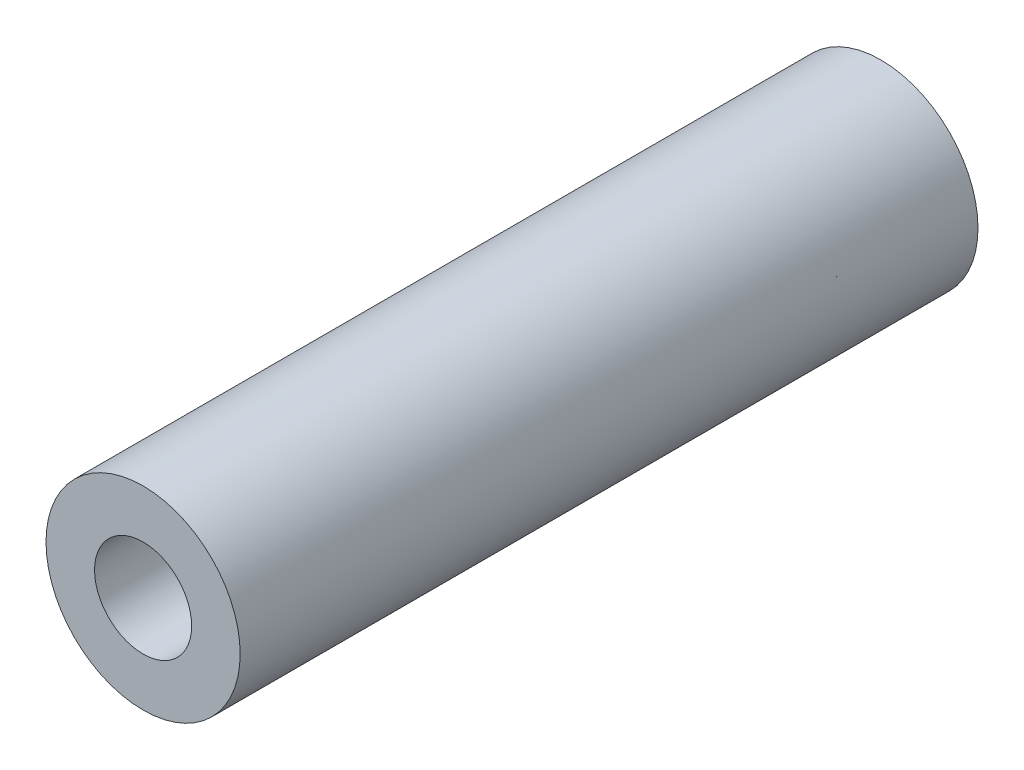
ISO-10303-21;
HEADER;
FILE_DESCRIPTION(('STEP AP214'),'2;1');
FILE_NAME('part.step','',(''),(''),'','','');
FILE_SCHEMA(('AUTOMOTIVE_DESIGN { 1 0 10303 214 1 1 1 1 }'));
ENDSEC;
DATA;
#1=APPLICATION_CONTEXT('core data for automotive mechanical design processes');
#2=APPLICATION_PROTOCOL_DEFINITION('international standard','automotive_design',2000,#1);
#3=PRODUCT_CONTEXT('',#1,'mechanical');
#4=PRODUCT('Part','Part','',(#3));
#5=PRODUCT_RELATED_PRODUCT_CATEGORY('part','',(#4));
#6=PRODUCT_DEFINITION_FORMATION('','',#4);
#7=PRODUCT_DEFINITION_CONTEXT('part definition',#1,'design');
#8=PRODUCT_DEFINITION('design','',#6,#7);
#9=PRODUCT_DEFINITION_SHAPE('','',#8);
#10=(LENGTH_UNIT() NAMED_UNIT(*) SI_UNIT(.MILLI.,.METRE.));
#11=(NAMED_UNIT(*) PLANE_ANGLE_UNIT() SI_UNIT($,.RADIAN.));
#12=(NAMED_UNIT(*) SI_UNIT($,.STERADIAN.) SOLID_ANGLE_UNIT());
#13=UNCERTAINTY_MEASURE_WITH_UNIT(LENGTH_MEASURE(1.E-05),#10,'distance_accuracy_value','');
#14=(GEOMETRIC_REPRESENTATION_CONTEXT(3) GLOBAL_UNCERTAINTY_ASSIGNED_CONTEXT((#13)) GLOBAL_UNIT_ASSIGNED_CONTEXT((#10,
#11,#12)) REPRESENTATION_CONTEXT('',''));
#15=CARTESIAN_POINT('',(0.,0.,0.));
#16=DIRECTION('',(0.,0.,1.));
#17=DIRECTION('',(1.,0.,0.));
#18=AXIS2_PLACEMENT_3D('',#15,#16,#17);
#19=CARTESIAN_POINT('',(0.,0.,9.5));
#20=DIRECTION('',(0.,0.,-1.));
#21=DIRECTION('',(-1.,0.,0.));
#22=AXIS2_PLACEMENT_3D('',#19,#20,#21);
#23=CYLINDRICAL_SURFACE('',#22,2.5);
#24=CARTESIAN_POINT('',(0.,0.,9.5));
#25=DIRECTION('',(0.,0.,1.));
#26=DIRECTION('',(1.,0.,0.));
#27=AXIS2_PLACEMENT_3D('',#24,#25,#26);
#28=CIRCLE('',#27,2.5);
#29=CARTESIAN_POINT('',(2.5,0.,9.5));
#30=VERTEX_POINT('',#29);
#31=EDGE_CURVE('E10',#30,#30,#28,.T.);
#32=ORIENTED_EDGE('',*,*,#31,.F.);
#33=EDGE_LOOP('',(#32));
#34=FACE_BOUND('',#33,.T.);
#35=CARTESIAN_POINT('',(0.,0.,-9.5));
#36=DIRECTION('',(0.,0.,1.));
#37=DIRECTION('',(1.,0.,0.));
#38=AXIS2_PLACEMENT_3D('',#35,#36,#37);
#39=CIRCLE('',#38,2.5);
#40=CARTESIAN_POINT('',(2.5,0.,-9.5));
#41=VERTEX_POINT('',#40);
#42=EDGE_CURVE('E38',#41,#41,#39,.T.);
#43=ORIENTED_EDGE('',*,*,#42,.T.);
#44=EDGE_LOOP('',(#43));
#45=FACE_BOUND('',#44,.T.);
#46=ADVANCED_FACE('F35',(#34,#45),#23,.T.);
#47=CARTESIAN_POINT('',(0.,0.,9.5));
#48=DIRECTION('',(0.,0.,1.));
#49=DIRECTION('',(1.,0.,0.));
#50=AXIS2_PLACEMENT_3D('',#47,#48,#49);
#51=PLANE('',#50);
#52=CARTESIAN_POINT('',(0.,0.,9.5));
#53=DIRECTION('',(0.,0.,1.));
#54=DIRECTION('',(1.,0.,0.));
#55=AXIS2_PLACEMENT_3D('',#52,#53,#54);
#56=CIRCLE('',#55,1.25);
#57=CARTESIAN_POINT('',(1.25,0.,9.5));
#58=VERTEX_POINT('',#57);
#59=EDGE_CURVE('E49',#58,#58,#56,.T.);
#60=ORIENTED_EDGE('',*,*,#59,.F.);
#61=EDGE_LOOP('',(#60));
#62=FACE_BOUND('',#61,.T.);
#63=ORIENTED_EDGE('',*,*,#31,.T.);
#64=EDGE_LOOP('',(#63));
#65=FACE_BOUND('',#64,.T.);
#66=ADVANCED_FACE('F55',(#62,#65),#51,.T.);
#67=CARTESIAN_POINT('',(0.,0.,-9.5));
#68=DIRECTION('',(0.,0.,1.));
#69=DIRECTION('',(1.,0.,0.));
#70=AXIS2_PLACEMENT_3D('',#67,#68,#69);
#71=PLANE('',#70);
#72=CARTESIAN_POINT('',(0.,0.,-9.5));
#73=DIRECTION('',(0.,0.,-1.));
#74=DIRECTION('',(-1.,0.,0.));
#75=AXIS2_PLACEMENT_3D('',#72,#73,#74);
#76=CIRCLE('',#75,1.25);
#77=CARTESIAN_POINT('',(-1.25,0.,-9.5));
#78=VERTEX_POINT('',#77);
#79=EDGE_CURVE('E45',#78,#78,#76,.T.);
#80=ORIENTED_EDGE('',*,*,#79,.F.);
#81=EDGE_LOOP('',(#80));
#82=FACE_BOUND('',#81,.T.);
#83=ORIENTED_EDGE('',*,*,#42,.F.);
#84=EDGE_LOOP('',(#83));
#85=FACE_BOUND('',#84,.T.);
#86=ADVANCED_FACE('F57',(#82,#85),#71,.F.);
#87=CARTESIAN_POINT('',(0.,0.,-9.5));
#88=DIRECTION('',(0.,0.,-1.));
#89=DIRECTION('',(-1.,0.,0.));
#90=AXIS2_PLACEMENT_3D('',#87,#88,#89);
#91=CYLINDRICAL_SURFACE('',#90,1.25);
#92=ORIENTED_EDGE('',*,*,#79,.T.);
#93=EDGE_LOOP('',(#92));
#94=FACE_BOUND('',#93,.T.);
#95=ORIENTED_EDGE('',*,*,#59,.T.);
#96=EDGE_LOOP('',(#95));
#97=FACE_BOUND('',#96,.T.);
#98=ADVANCED_FACE('F53',(#94,#97),#91,.F.);
#99=CLOSED_SHELL('',(#46,#66,#86,#98));
#100=MANIFOLD_SOLID_BREP('B2',#99);
#101=ADVANCED_BREP_SHAPE_REPRESENTATION('',(#18,#100),#14);
#102=SHAPE_DEFINITION_REPRESENTATION(#9,#101);
ENDSEC;
END-ISO-10303-21;
